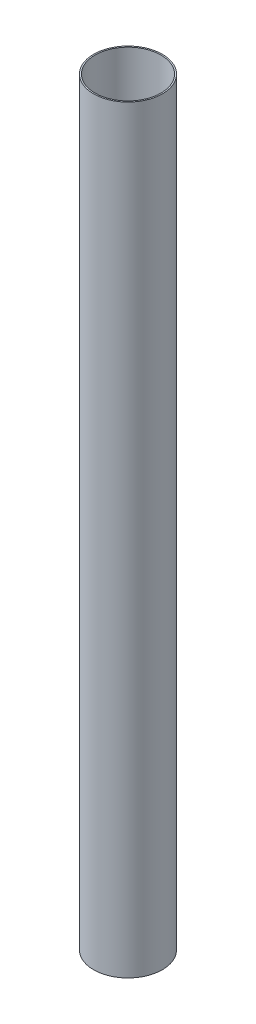
ISO-10303-21;
HEADER;
FILE_DESCRIPTION(('STEP AP214'),'2;1');
FILE_NAME('part.step','',(''),(''),'','','');
FILE_SCHEMA(('AUTOMOTIVE_DESIGN { 1 0 10303 214 1 1 1 1 }'));
ENDSEC;
DATA;
#1=APPLICATION_CONTEXT('core data for automotive mechanical design processes');
#2=APPLICATION_PROTOCOL_DEFINITION('international standard','automotive_design',2000,#1);
#3=PRODUCT_CONTEXT('',#1,'mechanical');
#4=PRODUCT('Part','Part','',(#3));
#5=PRODUCT_RELATED_PRODUCT_CATEGORY('part','',(#4));
#6=PRODUCT_DEFINITION_FORMATION('','',#4);
#7=PRODUCT_DEFINITION_CONTEXT('part definition',#1,'design');
#8=PRODUCT_DEFINITION('design','',#6,#7);
#9=PRODUCT_DEFINITION_SHAPE('','',#8);
#10=(LENGTH_UNIT() NAMED_UNIT(*) SI_UNIT(.MILLI.,.METRE.));
#11=(NAMED_UNIT(*) PLANE_ANGLE_UNIT() SI_UNIT($,.RADIAN.));
#12=(NAMED_UNIT(*) SI_UNIT($,.STERADIAN.) SOLID_ANGLE_UNIT());
#13=UNCERTAINTY_MEASURE_WITH_UNIT(LENGTH_MEASURE(1.E-05),#10,'distance_accuracy_value','');
#14=(GEOMETRIC_REPRESENTATION_CONTEXT(3) GLOBAL_UNCERTAINTY_ASSIGNED_CONTEXT((#13)) GLOBAL_UNIT_ASSIGNED_CONTEXT((#10,
#11,#12)) REPRESENTATION_CONTEXT('',''));
#15=CARTESIAN_POINT('',(0.,0.,0.));
#16=DIRECTION('',(0.,0.,1.));
#17=DIRECTION('',(1.,0.,0.));
#18=AXIS2_PLACEMENT_3D('',#15,#16,#17);
#19=CARTESIAN_POINT('',(0.,1752.6,0.));
#20=DIRECTION('',(0.,1.,0.));
#21=DIRECTION('',(0.,0.,1.));
#22=AXIS2_PLACEMENT_3D('',#19,#20,#21);
#23=PLANE('',#22);
#24=CARTESIAN_POINT('',(0.,1752.6,0.));
#25=DIRECTION('',(0.,1.,0.));
#26=DIRECTION('',(0.,0.,1.));
#27=AXIS2_PLACEMENT_3D('',#24,#25,#26);
#28=CIRCLE('',#27,79.375);
#29=CARTESIAN_POINT('',(0.,1752.6,79.375));
#30=VERTEX_POINT('',#29);
#31=EDGE_CURVE('E10',#30,#30,#28,.T.);
#32=ORIENTED_EDGE('',*,*,#31,.T.);
#33=EDGE_LOOP('',(#32));
#34=FACE_BOUND('',#33,.T.);
#35=CARTESIAN_POINT('',(0.,1752.6,0.));
#36=DIRECTION('',(0.,1.,0.));
#37=DIRECTION('',(0.,0.,1.));
#38=AXIS2_PLACEMENT_3D('',#35,#36,#37);
#39=CIRCLE('',#38,76.2);
#40=CARTESIAN_POINT('',(0.,1752.6,76.2));
#41=VERTEX_POINT('',#40);
#42=EDGE_CURVE('E44',#41,#41,#39,.T.);
#43=ORIENTED_EDGE('',*,*,#42,.F.);
#44=EDGE_LOOP('',(#43));
#45=FACE_BOUND('',#44,.T.);
#46=ADVANCED_FACE('F33',(#34,#45),#23,.T.);
#47=CARTESIAN_POINT('',(0.,0.,0.));
#48=DIRECTION('',(0.,1.,0.));
#49=DIRECTION('',(0.,0.,1.));
#50=AXIS2_PLACEMENT_3D('',#47,#48,#49);
#51=PLANE('',#50);
#52=CARTESIAN_POINT('',(0.,0.,0.));
#53=DIRECTION('',(0.,1.,0.));
#54=DIRECTION('',(0.,0.,1.));
#55=AXIS2_PLACEMENT_3D('',#52,#53,#54);
#56=CIRCLE('',#55,79.375);
#57=CARTESIAN_POINT('',(0.,0.,79.375));
#58=VERTEX_POINT('',#57);
#59=EDGE_CURVE('E37',#58,#58,#56,.T.);
#60=ORIENTED_EDGE('',*,*,#59,.F.);
#61=EDGE_LOOP('',(#60));
#62=FACE_BOUND('',#61,.T.);
#63=CARTESIAN_POINT('',(0.,0.,0.));
#64=DIRECTION('',(0.,1.,0.));
#65=DIRECTION('',(0.,0.,1.));
#66=AXIS2_PLACEMENT_3D('',#63,#64,#65);
#67=CIRCLE('',#66,76.2);
#68=CARTESIAN_POINT('',(0.,0.,76.2));
#69=VERTEX_POINT('',#68);
#70=EDGE_CURVE('E46',#69,#69,#67,.T.);
#71=ORIENTED_EDGE('',*,*,#70,.T.);
#72=EDGE_LOOP('',(#71));
#73=FACE_BOUND('',#72,.T.);
#74=ADVANCED_FACE('F56',(#62,#73),#51,.F.);
#75=CARTESIAN_POINT('',(0.,1752.6,0.));
#76=DIRECTION('',(0.,-1.,0.));
#77=DIRECTION('',(0.,0.,-1.));
#78=AXIS2_PLACEMENT_3D('',#75,#76,#77);
#79=CYLINDRICAL_SURFACE('',#78,79.375);
#80=ORIENTED_EDGE('',*,*,#31,.F.);
#81=EDGE_LOOP('',(#80));
#82=FACE_BOUND('',#81,.T.);
#83=ORIENTED_EDGE('',*,*,#59,.T.);
#84=EDGE_LOOP('',(#83));
#85=FACE_BOUND('',#84,.T.);
#86=ADVANCED_FACE('F35',(#82,#85),#79,.T.);
#87=CARTESIAN_POINT('',(0.,1752.6,0.));
#88=DIRECTION('',(0.,-1.,0.));
#89=DIRECTION('',(0.,0.,-1.));
#90=AXIS2_PLACEMENT_3D('',#87,#88,#89);
#91=CYLINDRICAL_SURFACE('',#90,76.2);
#92=ORIENTED_EDGE('',*,*,#42,.T.);
#93=EDGE_LOOP('',(#92));
#94=FACE_BOUND('',#93,.T.);
#95=ORIENTED_EDGE('',*,*,#70,.F.);
#96=EDGE_LOOP('',(#95));
#97=FACE_BOUND('',#96,.T.);
#98=ADVANCED_FACE('F52',(#94,#97),#91,.F.);
#99=CLOSED_SHELL('',(#46,#74,#86,#98));
#100=MANIFOLD_SOLID_BREP('B2',#99);
#101=ADVANCED_BREP_SHAPE_REPRESENTATION('',(#18,#100),#14);
#102=SHAPE_DEFINITION_REPRESENTATION(#9,#101);
ENDSEC;
END-ISO-10303-21;
